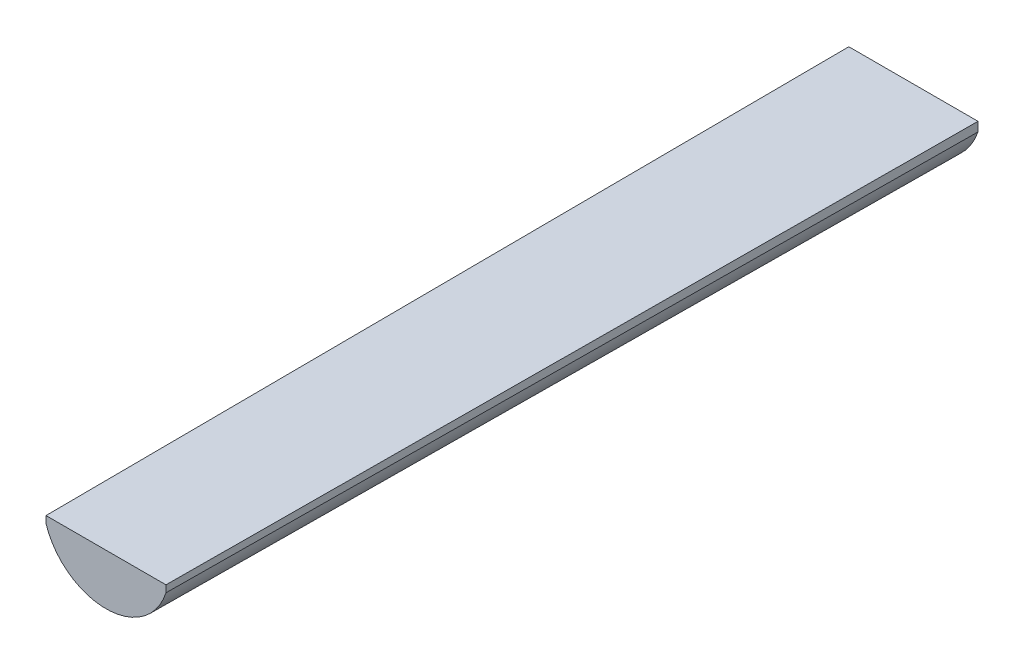
ISO-10303-21;
HEADER;
FILE_DESCRIPTION(('STEP AP214'),'2;1');
FILE_NAME('part.step','',(''),(''),'','','');
FILE_SCHEMA(('AUTOMOTIVE_DESIGN { 1 0 10303 214 1 1 1 1 }'));
ENDSEC;
DATA;
#1=APPLICATION_CONTEXT('core data for automotive mechanical design processes');
#2=APPLICATION_PROTOCOL_DEFINITION('international standard','automotive_design',2000,#1);
#3=PRODUCT_CONTEXT('',#1,'mechanical');
#4=PRODUCT('Part','Part','',(#3));
#5=PRODUCT_RELATED_PRODUCT_CATEGORY('part','',(#4));
#6=PRODUCT_DEFINITION_FORMATION('','',#4);
#7=PRODUCT_DEFINITION_CONTEXT('part definition',#1,'design');
#8=PRODUCT_DEFINITION('design','',#6,#7);
#9=PRODUCT_DEFINITION_SHAPE('','',#8);
#10=(LENGTH_UNIT() NAMED_UNIT(*) SI_UNIT(.MILLI.,.METRE.));
#11=(NAMED_UNIT(*) PLANE_ANGLE_UNIT() SI_UNIT($,.RADIAN.));
#12=(NAMED_UNIT(*) SI_UNIT($,.STERADIAN.) SOLID_ANGLE_UNIT());
#13=UNCERTAINTY_MEASURE_WITH_UNIT(LENGTH_MEASURE(1.E-05),#10,'distance_accuracy_value','');
#14=(GEOMETRIC_REPRESENTATION_CONTEXT(3) GLOBAL_UNCERTAINTY_ASSIGNED_CONTEXT((#13)) GLOBAL_UNIT_ASSIGNED_CONTEXT((#10,
#11,#12)) REPRESENTATION_CONTEXT('',''));
#15=CARTESIAN_POINT('',(0.,0.,0.));
#16=DIRECTION('',(0.,0.,1.));
#17=DIRECTION('',(1.,0.,0.));
#18=AXIS2_PLACEMENT_3D('',#15,#16,#17);
#19=CARTESIAN_POINT('',(0.,5.59999999999999,-350.));
#20=DIRECTION('',(0.,0.,-1.));
#21=DIRECTION('',(-1.,0.,0.));
#22=AXIS2_PLACEMENT_3D('',#19,#20,#21);
#23=PLANE('',#22);
#24=DIRECTION('',(0.,1.,0.));
#25=VECTOR('',#24,1.);
#26=CARTESIAN_POINT('',(28.,0.,-350.));
#27=LINE('',#26,#25);
#28=CARTESIAN_POINT('',(28.,-3.99999999999999,-350.));
#29=VERTEX_POINT('',#28);
#30=CARTESIAN_POINT('',(28.,0.,-350.));
#31=VERTEX_POINT('',#30);
#32=EDGE_CURVE('E141',#29,#31,#27,.T.);
#33=ORIENTED_EDGE('',*,*,#32,.F.);
#34=CARTESIAN_POINT('',(0.,5.59999999999999,-350.));
#35=DIRECTION('',(0.,0.,1.));
#36=DIRECTION('',(-1.,0.,0.));
#37=AXIS2_PLACEMENT_3D('',#34,#35,#36);
#38=CIRCLE('',#37,29.6);
#39=CARTESIAN_POINT('',(-28.,-4.00000000000001,-350.));
#40=VERTEX_POINT('',#39);
#41=EDGE_CURVE('E118',#40,#29,#38,.T.);
#42=ORIENTED_EDGE('',*,*,#41,.F.);
#43=DIRECTION('',(0.,-1.,0.));
#44=VECTOR('',#43,1.);
#45=CARTESIAN_POINT('',(-28.,0.,-350.));
#46=LINE('',#45,#44);
#47=CARTESIAN_POINT('',(-28.,0.,-350.));
#48=VERTEX_POINT('',#47);
#49=EDGE_CURVE('E102',#48,#40,#46,.T.);
#50=ORIENTED_EDGE('',*,*,#49,.F.);
#51=DIRECTION('',(-1.,0.,0.));
#52=VECTOR('',#51,1.);
#53=CARTESIAN_POINT('',(28.,0.,-350.));
#54=LINE('',#53,#52);
#55=EDGE_CURVE('E93',#31,#48,#54,.T.);
#56=ORIENTED_EDGE('',*,*,#55,.F.);
#57=EDGE_LOOP('',(#33,#42,#50,#56));
#58=FACE_BOUND('',#57,.T.);
#59=ADVANCED_FACE('F53',(#58),#23,.T.);
#60=CARTESIAN_POINT('',(0.,5.28947368421053,0.));
#61=DIRECTION('',(0.,0.,1.));
#62=DIRECTION('',(1.,0.,0.));
#63=AXIS2_PLACEMENT_3D('',#60,#61,#62);
#64=PLANE('',#63);
#65=DIRECTION('',(0.,-1.,0.));
#66=VECTOR('',#65,1.);
#67=CARTESIAN_POINT('',(-26.,0.,0.));
#68=LINE('',#67,#66);
#69=CARTESIAN_POINT('',(-26.,0.,0.));
#70=VERTEX_POINT('',#69);
#71=CARTESIAN_POINT('',(-26.,-2.99999999999999,0.));
#72=VERTEX_POINT('',#71);
#73=EDGE_CURVE('E106',#70,#72,#68,.T.);
#74=ORIENTED_EDGE('',*,*,#73,.T.);
#75=CARTESIAN_POINT('',(0.,5.28947368421053,0.));
#76=DIRECTION('',(0.,0.,1.));
#77=DIRECTION('',(1.,0.,0.));
#78=AXIS2_PLACEMENT_3D('',#75,#76,#77);
#79=CIRCLE('',#78,27.2894736842105);
#80=CARTESIAN_POINT('',(26.,-3.,0.));
#81=VERTEX_POINT('',#80);
#82=EDGE_CURVE('E181',#72,#81,#79,.T.);
#83=ORIENTED_EDGE('',*,*,#82,.T.);
#84=DIRECTION('',(0.,1.,0.));
#85=VECTOR('',#84,1.);
#86=CARTESIAN_POINT('',(26.,0.,0.));
#87=LINE('',#86,#85);
#88=CARTESIAN_POINT('',(26.,0.,0.));
#89=VERTEX_POINT('',#88);
#90=EDGE_CURVE('E64',#81,#89,#87,.T.);
#91=ORIENTED_EDGE('',*,*,#90,.T.);
#92=DIRECTION('',(-1.,0.,0.));
#93=VECTOR('',#92,1.);
#94=CARTESIAN_POINT('',(-26.,0.,0.));
#95=LINE('',#94,#93);
#96=EDGE_CURVE('E12',#89,#70,#95,.T.);
#97=ORIENTED_EDGE('',*,*,#96,.T.);
#98=EDGE_LOOP('',(#74,#83,#91,#97));
#99=FACE_BOUND('',#98,.T.);
#100=ADVANCED_FACE('F235',(#99),#64,.T.);
#101=CARTESIAN_POINT('',(25.999151048129,0.,0.148566577417881));
#102=DIRECTION('',(0.99998367386921,0.,0.00571419242210979));
#103=DIRECTION('',(0.00571419242210979,0.,-0.99998367386921));
#104=AXIS2_PLACEMENT_3D('',#101,#102,#103);
#105=PLANE('',#104);
#106=DIRECTION('',(0.00571416909977975,-0.00285708454988985,-0.999979592461453));
#107=VECTOR('',#106,1.);
#108=CARTESIAN_POINT('',(26.,-3.,0.));
#109=LINE('',#108,#107);
#110=EDGE_CURVE('E163',#81,#29,#109,.T.);
#111=ORIENTED_EDGE('',*,*,#110,.T.);
#112=ORIENTED_EDGE('',*,*,#32,.T.);
#113=DIRECTION('',(0.00571419242210978,0.,-0.99998367386921));
#114=VECTOR('',#113,1.);
#115=CARTESIAN_POINT('',(26.,0.,0.));
#116=LINE('',#115,#114);
#117=EDGE_CURVE('E73',#89,#31,#116,.T.);
#118=ORIENTED_EDGE('',*,*,#117,.F.);
#119=ORIENTED_EDGE('',*,*,#90,.F.);
#120=EDGE_LOOP('',(#111,#112,#118,#119));
#121=FACE_BOUND('',#120,.T.);
#122=ADVANCED_FACE('F167',(#121),#105,.T.);
#123=CARTESIAN_POINT('',(0.,0.,0.));
#124=DIRECTION('',(0.,1.,0.));
#125=DIRECTION('',(0.,0.,1.));
#126=AXIS2_PLACEMENT_3D('',#123,#124,#125);
#127=PLANE('',#126);
#128=ORIENTED_EDGE('',*,*,#117,.T.);
#129=ORIENTED_EDGE('',*,*,#55,.T.);
#130=DIRECTION('',(-0.00571419242210978,0.,-0.99998367386921));
#131=VECTOR('',#130,1.);
#132=CARTESIAN_POINT('',(-26.,0.,0.));
#133=LINE('',#132,#131);
#134=EDGE_CURVE('E99',#70,#48,#133,.T.);
#135=ORIENTED_EDGE('',*,*,#134,.F.);
#136=ORIENTED_EDGE('',*,*,#96,.F.);
#137=EDGE_LOOP('',(#128,#129,#135,#136));
#138=FACE_BOUND('',#137,.T.);
#139=ADVANCED_FACE('F112',(#138),#127,.T.);
#140=CARTESIAN_POINT('',(26.,-3.,0.));
#141=CARTESIAN_POINT('',(28.,-3.99999999999999,-350.));
#142=CARTESIAN_POINT('',(25.6709257473481,-4.03214400514304,0.));
#143=CARTESIAN_POINT('',(27.6216216216216,-5.10360360360359,-350.));
#144=CARTESIAN_POINT('',(25.2660188000979,-5.0900767088244,0.));
#145=CARTESIAN_POINT('',(27.1619384276877,-6.23192117397393,-350.));
#146=CARTESIAN_POINT('',(24.2761530372194,-7.23151533750637,0.));
#147=CARTESIAN_POINT('',(26.0515447183797,-8.50965185973391,-350.));
#148=CARTESIAN_POINT('',(23.6910351230577,-8.31506377441893,0.));
#149=CARTESIAN_POINT('',(25.400671786757,-9.65909785174263,-350.));
#150=CARTESIAN_POINT('',(22.3159325271378,-10.4695789557624,0.));
#151=CARTESIAN_POINT('',(23.8837682528862,-11.9385235555913,-350.));
#152=CARTESIAN_POINT('',(21.5257409930837,-11.540515667903,0.));
#153=CARTESIAN_POINT('',(23.0175331833499,-13.0684616035923,-350.));
#154=CARTESIAN_POINT('',(19.7250000805647,-13.6190016301903,0.));
#155=CARTESIAN_POINT('',(21.0558515547516,-15.2559202097552,-350.));
#156=CARTESIAN_POINT('',(18.714233584995,-14.6264082100085,0.));
#157=CARTESIAN_POINT('',(19.9601973751561,-16.3132886987026,-350.));
#158=CARTESIAN_POINT('',(16.4727158440425,-16.5168218063048,0.));
#159=CARTESIAN_POINT('',(17.5420650682828,-18.2930461429264,-350.));
#160=CARTESIAN_POINT('',(15.2418080096739,-17.3995563782235,0.));
#161=CARTESIAN_POINT('',(16.2194446610833,-19.2151607589763,-350.));
#162=CARTESIAN_POINT('',(12.5821551834119,-18.9756075544405,0.));
#163=CARTESIAN_POINT('',(13.3717484362092,-20.8586268042489,-350.));
#164=CARTESIAN_POINT('',(11.1534005725932,-19.6685567610819,0.));
#165=CARTESIAN_POINT('',(11.8466754573471,-21.5796190671183,-350.));
#166=CARTESIAN_POINT('',(8.14480109153845,-20.8058102425863,0.));
#167=CARTESIAN_POINT('',(8.64281774413621,-22.7615428611882,-350.));
#168=CARTESIAN_POINT('',(6.56515148269718,-21.2497504295914,0.));
#169=CARTESIAN_POINT('',(6.96423120238842,-23.2221248880304,-350.));
#170=CARTESIAN_POINT('',(3.3234903511137,-21.8469601721278,0.));
#171=CARTESIAN_POINT('',(3.52358910764008,-23.8414625842885,-350.));
#172=CARTESIAN_POINT('',(1.66185897435897,-22.,0.));
#173=CARTESIAN_POINT('',(1.76190476190477,-24.,-350.));
#174=CARTESIAN_POINT('',(-1.66185897435898,-22.,0.));
#175=CARTESIAN_POINT('',(-1.76190476190476,-24.,-350.));
#176=CARTESIAN_POINT('',(-3.32349035111371,-21.8469601721278,0.));
#177=CARTESIAN_POINT('',(-3.52358910764006,-23.8414625842885,-350.));
#178=CARTESIAN_POINT('',(-6.56515148269719,-21.2497504295914,0.));
#179=CARTESIAN_POINT('',(-6.96423120238841,-23.2221248880304,-350.));
#180=CARTESIAN_POINT('',(-8.14480109153846,-20.8058102425863,0.));
#181=CARTESIAN_POINT('',(-8.64281774413619,-22.7615428611882,-350.));
#182=CARTESIAN_POINT('',(-11.1534005725933,-19.6685567610819,0.));
#183=CARTESIAN_POINT('',(-11.8466754573471,-21.5796190671183,-350.));
#184=CARTESIAN_POINT('',(-12.5821551834119,-18.9756075544405,0.));
#185=CARTESIAN_POINT('',(-13.3717484362092,-20.8586268042489,-350.));
#186=CARTESIAN_POINT('',(-15.2418080096739,-17.3995563782235,0.));
#187=CARTESIAN_POINT('',(-16.2194446610833,-19.2151607589763,-350.));
#188=CARTESIAN_POINT('',(-16.4727158440425,-16.5168218063048,0.));
#189=CARTESIAN_POINT('',(-17.5420650682828,-18.2930461429264,-350.));
#190=CARTESIAN_POINT('',(-18.7142335849951,-14.6264082100084,0.));
#191=CARTESIAN_POINT('',(-19.9601973751561,-16.3132886987026,-350.));
#192=CARTESIAN_POINT('',(-19.7250000805647,-13.6190016301903,0.));
#193=CARTESIAN_POINT('',(-21.0558515547516,-15.2559202097553,-350.));
#194=CARTESIAN_POINT('',(-21.5257409930837,-11.540515667903,0.));
#195=CARTESIAN_POINT('',(-23.0175331833499,-13.0684616035923,-350.));
#196=CARTESIAN_POINT('',(-22.3159325271378,-10.4695789557624,0.));
#197=CARTESIAN_POINT('',(-23.8837682528862,-11.9385235555914,-350.));
#198=CARTESIAN_POINT('',(-23.6910351230577,-8.31506377441892,0.));
#199=CARTESIAN_POINT('',(-25.400671786757,-9.65909785174265,-350.));
#200=CARTESIAN_POINT('',(-24.2761530372194,-7.23151533750637,0.));
#201=CARTESIAN_POINT('',(-26.0515447183797,-8.50965185973393,-350.));
#202=CARTESIAN_POINT('',(-25.2660188000979,-5.0900767088244,0.));
#203=CARTESIAN_POINT('',(-27.1619384276877,-6.23192117397395,-350.));
#204=CARTESIAN_POINT('',(-25.6709257473481,-4.03214400514303,0.));
#205=CARTESIAN_POINT('',(-27.6216216216216,-5.10360360360361,-350.));
#206=CARTESIAN_POINT('',(-26.,-2.99999999999999,0.));
#207=CARTESIAN_POINT('',(-28.,-4.00000000000001,-350.));
#208=B_SPLINE_SURFACE_WITH_KNOTS('',3,1,((#140,#141),(#142,#143),(#144,#145),(#146,#147),(#148,
#149),(#150,#151),(#152,#153),(#154,#155),(#156,#157),(#158,#159),(#160,#161),(#162,#163),(#164,
#165),(#166,#167),(#168,#169),(#170,#171),(#172,#173),(#174,#175),(#176,#177),(#178,#179),(#180,
#181),(#182,#183),(#184,#185),(#186,#187),(#188,#189),(#190,#191),(#192,#193),(#194,#195),(#196,
#197),(#198,#199),(#200,#201),(#202,#203),(#204,#205),(#206,#207)),.UNSPECIFIED.,.F.,.F.,.F.,(4,
2,2,2,2,2,2,2,2,2,2,2,2,2,2,2,4),(2,2),(0.,0.0625,0.125,0.1875,0.25,0.3125,0.375,0.4375,0.5,
0.5625,0.625,0.6875,0.75,0.8125,0.875,0.9375,1.),(0.,1.),.UNSPECIFIED.);
#209=DIRECTION('',(-0.00571416909977972,-0.00285708454988992,-0.999979592461453));
#210=VECTOR('',#209,1.);
#211=CARTESIAN_POINT('',(-27.,-3.5,-175.));
#212=LINE('',#211,#210);
#213=EDGE_CURVE('E109',#72,#40,#212,.T.);
#214=ORIENTED_EDGE('',*,*,#82,.F.);
#215=ORIENTED_EDGE('',*,*,#213,.T.);
#216=ORIENTED_EDGE('',*,*,#41,.T.);
#217=ORIENTED_EDGE('',*,*,#110,.F.);
#218=EDGE_LOOP('',(#214,#215,#216,#217));
#219=FACE_BOUND('',#218,.T.);
#220=ADVANCED_FACE('F162',(#219),#208,.T.);
#221=CARTESIAN_POINT('',(-25.999151048129,0.,0.14856657741788));
#222=DIRECTION('',(-0.99998367386921,0.,0.00571419242210978));
#223=DIRECTION('',(0.00571419242210978,0.,0.99998367386921));
#224=AXIS2_PLACEMENT_3D('',#221,#222,#223);
#225=PLANE('',#224);
#226=ORIENTED_EDGE('',*,*,#134,.T.);
#227=ORIENTED_EDGE('',*,*,#49,.T.);
#228=ORIENTED_EDGE('',*,*,#213,.F.);
#229=ORIENTED_EDGE('',*,*,#73,.F.);
#230=EDGE_LOOP('',(#226,#227,#228,#229));
#231=FACE_BOUND('',#230,.T.);
#232=ADVANCED_FACE('F100',(#231),#225,.T.);
#233=CLOSED_SHELL('',(#59,#100,#122,#139,#220,#232));
#234=MANIFOLD_SOLID_BREP('B2',#233);
#235=ADVANCED_BREP_SHAPE_REPRESENTATION('',(#18,#234),#14);
#236=SHAPE_DEFINITION_REPRESENTATION(#9,#235);
ENDSEC;
END-ISO-10303-21;
